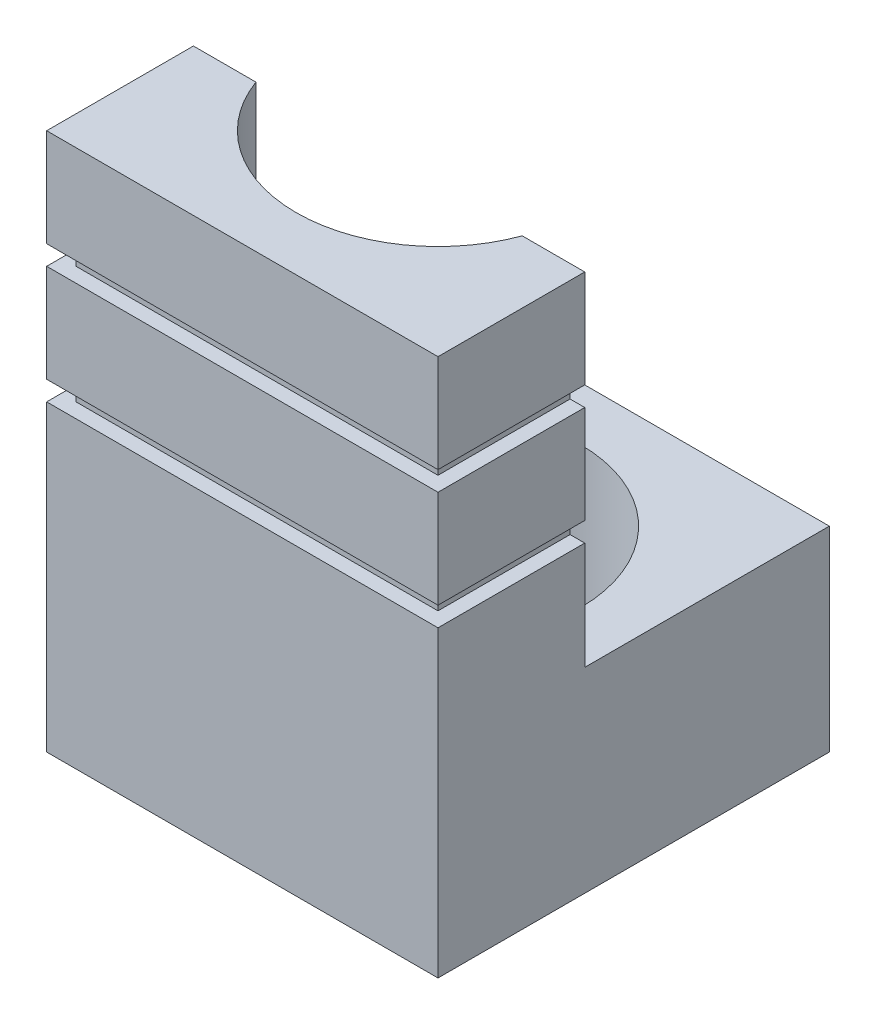
ISO-10303-21;
HEADER;
FILE_DESCRIPTION(('STEP AP214'),'2;1');
FILE_NAME('part.step','',(''),(''),'','','');
FILE_SCHEMA(('AUTOMOTIVE_DESIGN { 1 0 10303 214 1 1 1 1 }'));
ENDSEC;
DATA;
#1=APPLICATION_CONTEXT('core data for automotive mechanical design processes');
#2=APPLICATION_PROTOCOL_DEFINITION('international standard','automotive_design',2000,#1);
#3=PRODUCT_CONTEXT('',#1,'mechanical');
#4=PRODUCT('Part','Part','',(#3));
#5=PRODUCT_RELATED_PRODUCT_CATEGORY('part','',(#4));
#6=PRODUCT_DEFINITION_FORMATION('','',#4);
#7=PRODUCT_DEFINITION_CONTEXT('part definition',#1,'design');
#8=PRODUCT_DEFINITION('design','',#6,#7);
#9=PRODUCT_DEFINITION_SHAPE('','',#8);
#10=(LENGTH_UNIT() NAMED_UNIT(*) SI_UNIT(.MILLI.,.METRE.));
#11=(NAMED_UNIT(*) PLANE_ANGLE_UNIT() SI_UNIT($,.RADIAN.));
#12=(NAMED_UNIT(*) SI_UNIT($,.STERADIAN.) SOLID_ANGLE_UNIT());
#13=UNCERTAINTY_MEASURE_WITH_UNIT(LENGTH_MEASURE(1.E-05),#10,'distance_accuracy_value','');
#14=(GEOMETRIC_REPRESENTATION_CONTEXT(3) GLOBAL_UNCERTAINTY_ASSIGNED_CONTEXT((#13)) GLOBAL_UNIT_ASSIGNED_CONTEXT((#10,
#11,#12)) REPRESENTATION_CONTEXT('',''));
#15=CARTESIAN_POINT('',(0.,0.,0.));
#16=DIRECTION('',(0.,0.,1.));
#17=DIRECTION('',(1.,0.,0.));
#18=AXIS2_PLACEMENT_3D('',#15,#16,#17);
#19=CARTESIAN_POINT('',(80.,110.,0.));
#20=DIRECTION('',(0.,0.,-1.));
#21=DIRECTION('',(0.,1.,0.));
#22=AXIS2_PLACEMENT_3D('',#19,#20,#21);
#23=PLANE('',#22);
#24=DIRECTION('',(0.,-1.,0.));
#25=VECTOR('',#24,1.);
#26=CARTESIAN_POINT('',(0.,110.,0.));
#27=LINE('',#26,#25);
#28=CARTESIAN_POINT('',(0.,110.,0.));
#29=VERTEX_POINT('',#28);
#30=CARTESIAN_POINT('',(0.,90.,0.));
#31=VERTEX_POINT('',#30);
#32=EDGE_CURVE('E375',#29,#31,#27,.T.);
#33=ORIENTED_EDGE('',*,*,#32,.T.);
#34=DIRECTION('',(1.,0.,0.));
#35=VECTOR('',#34,1.);
#36=CARTESIAN_POINT('',(77.,90.,0.));
#37=LINE('',#36,#35);
#38=CARTESIAN_POINT('',(80.,90.,0.));
#39=VERTEX_POINT('',#38);
#40=EDGE_CURVE('E288',#31,#39,#37,.T.);
#41=ORIENTED_EDGE('',*,*,#40,.T.);
#42=DIRECTION('',(0.,-1.,0.));
#43=VECTOR('',#42,1.);
#44=CARTESIAN_POINT('',(80.,110.,0.));
#45=LINE('',#44,#43);
#46=CARTESIAN_POINT('',(80.,110.,0.));
#47=VERTEX_POINT('',#46);
#48=EDGE_CURVE('E350',#47,#39,#45,.T.);
#49=ORIENTED_EDGE('',*,*,#48,.F.);
#50=DIRECTION('',(-1.,0.,0.));
#51=VECTOR('',#50,1.);
#52=CARTESIAN_POINT('',(80.,110.,0.));
#53=LINE('',#52,#51);
#54=EDGE_CURVE('E374',#47,#29,#53,.T.);
#55=ORIENTED_EDGE('',*,*,#54,.T.);
#56=EDGE_LOOP('',(#33,#41,#49,#55));
#57=FACE_BOUND('',#56,.T.);
#58=ADVANCED_FACE('F37',(#57),#23,.F.);
#59=DIRECTION('',(1.,0.,0.));
#60=VECTOR('',#59,1.);
#61=CARTESIAN_POINT('',(77.,86.,0.));
#62=LINE('',#61,#60);
#63=CARTESIAN_POINT('',(0.,86.,0.));
#64=VERTEX_POINT('',#63);
#65=CARTESIAN_POINT('',(80.,86.,0.));
#66=VERTEX_POINT('',#65);
#67=EDGE_CURVE('E281',#64,#66,#62,.T.);
#68=ORIENTED_EDGE('',*,*,#67,.F.);
#69=CARTESIAN_POINT('',(0.,66.,0.));
#70=VERTEX_POINT('',#69);
#71=EDGE_CURVE('E380',#64,#70,#27,.T.);
#72=ORIENTED_EDGE('',*,*,#71,.T.);
#73=DIRECTION('',(1.,0.,0.));
#74=VECTOR('',#73,1.);
#75=CARTESIAN_POINT('',(77.,66.,0.));
#76=LINE('',#75,#74);
#77=CARTESIAN_POINT('',(80.,66.,0.));
#78=VERTEX_POINT('',#77);
#79=EDGE_CURVE('E285',#70,#78,#76,.T.);
#80=ORIENTED_EDGE('',*,*,#79,.T.);
#81=EDGE_CURVE('E355',#66,#78,#45,.T.);
#82=ORIENTED_EDGE('',*,*,#81,.F.);
#83=EDGE_LOOP('',(#68,#72,#80,#82));
#84=FACE_BOUND('',#83,.T.);
#85=ADVANCED_FACE('F462',(#84),#23,.F.);
#86=CARTESIAN_POINT('',(77.,0.,0.));
#87=DIRECTION('',(1.,0.,0.));
#88=DIRECTION('',(0.,0.,-1.));
#89=AXIS2_PLACEMENT_3D('',#86,#87,#88);
#90=PLANE('',#89);
#91=DIRECTION('',(0.,0.,1.));
#92=VECTOR('',#91,1.);
#93=CARTESIAN_POINT('',(77.,66.,0.));
#94=LINE('',#93,#92);
#95=CARTESIAN_POINT('',(77.,66.,-30.));
#96=VERTEX_POINT('',#95);
#97=CARTESIAN_POINT('',(77.,66.,-3.));
#98=VERTEX_POINT('',#97);
#99=EDGE_CURVE('E309',#96,#98,#94,.T.);
#100=ORIENTED_EDGE('',*,*,#99,.T.);
#101=DIRECTION('',(0.,1.,0.));
#102=VECTOR('',#101,1.);
#103=CARTESIAN_POINT('',(77.,66.,-3.));
#104=LINE('',#103,#102);
#105=CARTESIAN_POINT('',(77.,62.,-3.));
#106=VERTEX_POINT('',#105);
#107=EDGE_CURVE('E526',#106,#98,#104,.T.);
#108=ORIENTED_EDGE('',*,*,#107,.F.);
#109=DIRECTION('',(0.,0.,-1.));
#110=VECTOR('',#109,1.);
#111=CARTESIAN_POINT('',(77.,62.,0.));
#112=LINE('',#111,#110);
#113=CARTESIAN_POINT('',(77.,62.,-30.));
#114=VERTEX_POINT('',#113);
#115=EDGE_CURVE('E302',#106,#114,#112,.T.);
#116=ORIENTED_EDGE('',*,*,#115,.T.);
#117=DIRECTION('',(0.,1.,0.));
#118=VECTOR('',#117,1.);
#119=CARTESIAN_POINT('',(77.,66.,-30.));
#120=LINE('',#119,#118);
#121=EDGE_CURVE('E305',#114,#96,#120,.T.);
#122=ORIENTED_EDGE('',*,*,#121,.T.);
#123=EDGE_LOOP('',(#100,#108,#116,#122));
#124=FACE_BOUND('',#123,.T.);
#125=ADVANCED_FACE('F535',(#124),#90,.T.);
#126=CARTESIAN_POINT('',(77.,0.,0.));
#127=DIRECTION('',(1.,0.,0.));
#128=DIRECTION('',(0.,0.,-1.));
#129=AXIS2_PLACEMENT_3D('',#126,#127,#128);
#130=PLANE('',#129);
#131=DIRECTION('',(0.,0.,1.));
#132=VECTOR('',#131,1.);
#133=CARTESIAN_POINT('',(77.,90.,0.));
#134=LINE('',#133,#132);
#135=CARTESIAN_POINT('',(77.,90.,-30.));
#136=VERTEX_POINT('',#135);
#137=CARTESIAN_POINT('',(77.,90.,-3.));
#138=VERTEX_POINT('',#137);
#139=EDGE_CURVE('E277',#136,#138,#134,.T.);
#140=ORIENTED_EDGE('',*,*,#139,.T.);
#141=DIRECTION('',(0.,1.,0.));
#142=VECTOR('',#141,1.);
#143=CARTESIAN_POINT('',(77.,90.,-3.));
#144=LINE('',#143,#142);
#145=CARTESIAN_POINT('',(77.,86.,-3.));
#146=VERTEX_POINT('',#145);
#147=EDGE_CURVE('E210',#146,#138,#144,.T.);
#148=ORIENTED_EDGE('',*,*,#147,.F.);
#149=DIRECTION('',(0.,0.,-1.));
#150=VECTOR('',#149,1.);
#151=CARTESIAN_POINT('',(77.,86.,0.));
#152=LINE('',#151,#150);
#153=CARTESIAN_POINT('',(77.,86.,-30.));
#154=VERTEX_POINT('',#153);
#155=EDGE_CURVE('E207',#146,#154,#152,.T.);
#156=ORIENTED_EDGE('',*,*,#155,.T.);
#157=DIRECTION('',(0.,1.,0.));
#158=VECTOR('',#157,1.);
#159=CARTESIAN_POINT('',(77.,90.,-30.));
#160=LINE('',#159,#158);
#161=EDGE_CURVE('E273',#154,#136,#160,.T.);
#162=ORIENTED_EDGE('',*,*,#161,.T.);
#163=EDGE_LOOP('',(#140,#148,#156,#162));
#164=FACE_BOUND('',#163,.T.);
#165=ADVANCED_FACE('F512',(#164),#130,.T.);
#166=CARTESIAN_POINT('',(3.,0.,0.));
#167=DIRECTION('',(-1.,0.,0.));
#168=DIRECTION('',(0.,0.,1.));
#169=AXIS2_PLACEMENT_3D('',#166,#167,#168);
#170=PLANE('',#169);
#171=DIRECTION('',(0.,0.,1.));
#172=VECTOR('',#171,1.);
#173=CARTESIAN_POINT('',(3.,62.,-30.));
#174=LINE('',#173,#172);
#175=CARTESIAN_POINT('',(3.,62.,-30.));
#176=VERTEX_POINT('',#175);
#177=CARTESIAN_POINT('',(3.,62.,-3.));
#178=VERTEX_POINT('',#177);
#179=EDGE_CURVE('E251',#176,#178,#174,.T.);
#180=ORIENTED_EDGE('',*,*,#179,.T.);
#181=DIRECTION('',(0.,-1.,0.));
#182=VECTOR('',#181,1.);
#183=CARTESIAN_POINT('',(3.,66.,-3.));
#184=LINE('',#183,#182);
#185=CARTESIAN_POINT('',(3.,66.,-3.00000000000001));
#186=VERTEX_POINT('',#185);
#187=EDGE_CURVE('E520',#186,#178,#184,.T.);
#188=ORIENTED_EDGE('',*,*,#187,.F.);
#189=DIRECTION('',(0.,0.,-1.));
#190=VECTOR('',#189,1.);
#191=CARTESIAN_POINT('',(3.,66.,-30.));
#192=LINE('',#191,#190);
#193=CARTESIAN_POINT('',(3.,66.,-30.));
#194=VERTEX_POINT('',#193);
#195=EDGE_CURVE('E256',#186,#194,#192,.T.);
#196=ORIENTED_EDGE('',*,*,#195,.T.);
#197=DIRECTION('',(0.,-1.,0.));
#198=VECTOR('',#197,1.);
#199=CARTESIAN_POINT('',(3.,66.,-30.));
#200=LINE('',#199,#198);
#201=EDGE_CURVE('E247',#194,#176,#200,.T.);
#202=ORIENTED_EDGE('',*,*,#201,.T.);
#203=EDGE_LOOP('',(#180,#188,#196,#202));
#204=FACE_BOUND('',#203,.T.);
#205=ADVANCED_FACE('F542',(#204),#170,.T.);
#206=CARTESIAN_POINT('',(3.,0.,0.));
#207=DIRECTION('',(1.,0.,0.));
#208=DIRECTION('',(0.,0.,-1.));
#209=AXIS2_PLACEMENT_3D('',#206,#207,#208);
#210=PLANE('',#209);
#211=DIRECTION('',(0.,-1.,0.));
#212=VECTOR('',#211,1.);
#213=CARTESIAN_POINT('',(3.,90.,-3.));
#214=LINE('',#213,#212);
#215=CARTESIAN_POINT('',(3.,90.,-3.));
#216=VERTEX_POINT('',#215);
#217=CARTESIAN_POINT('',(3.,86.,-3.));
#218=VERTEX_POINT('',#217);
#219=EDGE_CURVE('E211',#216,#218,#214,.T.);
#220=ORIENTED_EDGE('',*,*,#219,.F.);
#221=DIRECTION('',(0.,0.,-1.));
#222=VECTOR('',#221,1.);
#223=CARTESIAN_POINT('',(3.,90.,-30.));
#224=LINE('',#223,#222);
#225=CARTESIAN_POINT('',(3.,90.,-30.));
#226=VERTEX_POINT('',#225);
#227=EDGE_CURVE('E223',#216,#226,#224,.T.);
#228=ORIENTED_EDGE('',*,*,#227,.T.);
#229=DIRECTION('',(0.,-1.,0.));
#230=VECTOR('',#229,1.);
#231=CARTESIAN_POINT('',(3.,90.,-30.));
#232=LINE('',#231,#230);
#233=CARTESIAN_POINT('',(3.,86.,-30.));
#234=VERTEX_POINT('',#233);
#235=EDGE_CURVE('E220',#226,#234,#232,.T.);
#236=ORIENTED_EDGE('',*,*,#235,.T.);
#237=DIRECTION('',(0.,0.,1.));
#238=VECTOR('',#237,1.);
#239=CARTESIAN_POINT('',(3.,86.,0.));
#240=LINE('',#239,#238);
#241=EDGE_CURVE('E204',#234,#218,#240,.T.);
#242=ORIENTED_EDGE('',*,*,#241,.T.);
#243=EDGE_LOOP('',(#220,#228,#236,#242));
#244=FACE_BOUND('',#243,.T.);
#245=ADVANCED_FACE('F218',(#244),#210,.F.);
#246=CARTESIAN_POINT('',(0.,0.,0.));
#247=DIRECTION('',(1.,0.,0.));
#248=DIRECTION('',(0.,0.,-1.));
#249=AXIS2_PLACEMENT_3D('',#246,#247,#248);
#250=PLANE('',#249);
#251=DIRECTION('',(0.,1.,0.));
#252=VECTOR('',#251,1.);
#253=CARTESIAN_POINT('',(0.,40.,-30.));
#254=LINE('',#253,#252);
#255=CARTESIAN_POINT('',(0.,90.,-30.));
#256=VERTEX_POINT('',#255);
#257=CARTESIAN_POINT('',(0.,110.,-30.));
#258=VERTEX_POINT('',#257);
#259=EDGE_CURVE('E390',#256,#258,#254,.T.);
#260=ORIENTED_EDGE('',*,*,#259,.F.);
#261=DIRECTION('',(0.,0.,-1.));
#262=VECTOR('',#261,1.);
#263=CARTESIAN_POINT('',(0.,90.,-30.));
#264=LINE('',#263,#262);
#265=EDGE_CURVE('E229',#31,#256,#264,.T.);
#266=ORIENTED_EDGE('',*,*,#265,.F.);
#267=ORIENTED_EDGE('',*,*,#32,.F.);
#268=DIRECTION('',(0.,0.,1.));
#269=VECTOR('',#268,1.);
#270=CARTESIAN_POINT('',(0.,110.,-30.));
#271=LINE('',#270,#269);
#272=EDGE_CURVE('E395',#258,#29,#271,.T.);
#273=ORIENTED_EDGE('',*,*,#272,.F.);
#274=EDGE_LOOP('',(#260,#266,#267,#273));
#275=FACE_BOUND('',#274,.T.);
#276=ADVANCED_FACE('F490',(#275),#250,.F.);
#277=ORIENTED_EDGE('',*,*,#71,.F.);
#278=DIRECTION('',(0.,0.,1.));
#279=VECTOR('',#278,1.);
#280=CARTESIAN_POINT('',(0.,86.,0.));
#281=LINE('',#280,#279);
#282=CARTESIAN_POINT('',(0.,86.,-30.));
#283=VERTEX_POINT('',#282);
#284=EDGE_CURVE('E233',#283,#64,#281,.T.);
#285=ORIENTED_EDGE('',*,*,#284,.F.);
#286=CARTESIAN_POINT('',(0.,66.,-30.));
#287=VERTEX_POINT('',#286);
#288=EDGE_CURVE('E396',#287,#283,#254,.T.);
#289=ORIENTED_EDGE('',*,*,#288,.F.);
#290=DIRECTION('',(0.,0.,-1.));
#291=VECTOR('',#290,1.);
#292=CARTESIAN_POINT('',(0.,66.,-30.));
#293=LINE('',#292,#291);
#294=EDGE_CURVE('E252',#70,#287,#293,.T.);
#295=ORIENTED_EDGE('',*,*,#294,.F.);
#296=EDGE_LOOP('',(#277,#285,#289,#295));
#297=FACE_BOUND('',#296,.T.);
#298=ADVANCED_FACE('F471',(#297),#250,.F.);
#299=CARTESIAN_POINT('',(80.,0.,0.));
#300=DIRECTION('',(1.,0.,0.));
#301=DIRECTION('',(0.,0.,-1.));
#302=AXIS2_PLACEMENT_3D('',#299,#300,#301);
#303=PLANE('',#302);
#304=DIRECTION('',(0.,0.,1.));
#305=VECTOR('',#304,1.);
#306=CARTESIAN_POINT('',(80.,90.,0.));
#307=LINE('',#306,#305);
#308=CARTESIAN_POINT('',(80.,90.,-30.));
#309=VERTEX_POINT('',#308);
#310=EDGE_CURVE('E274',#309,#39,#307,.T.);
#311=ORIENTED_EDGE('',*,*,#310,.F.);
#312=DIRECTION('',(0.,1.,0.));
#313=VECTOR('',#312,1.);
#314=CARTESIAN_POINT('',(80.,40.,-30.));
#315=LINE('',#314,#313);
#316=CARTESIAN_POINT('',(80.,110.,-30.));
#317=VERTEX_POINT('',#316);
#318=EDGE_CURVE('E365',#309,#317,#315,.T.);
#319=ORIENTED_EDGE('',*,*,#318,.T.);
#320=DIRECTION('',(0.,0.,1.));
#321=VECTOR('',#320,1.);
#322=CARTESIAN_POINT('',(80.,110.,-30.));
#323=LINE('',#322,#321);
#324=EDGE_CURVE('E370',#317,#47,#323,.T.);
#325=ORIENTED_EDGE('',*,*,#324,.T.);
#326=ORIENTED_EDGE('',*,*,#48,.T.);
#327=EDGE_LOOP('',(#311,#319,#325,#326));
#328=FACE_BOUND('',#327,.T.);
#329=ADVANCED_FACE('F497',(#328),#303,.T.);
#330=DIRECTION('',(0.,0.,-1.));
#331=VECTOR('',#330,1.);
#332=CARTESIAN_POINT('',(80.,86.,0.));
#333=LINE('',#332,#331);
#334=CARTESIAN_POINT('',(80.,86.,-30.));
#335=VERTEX_POINT('',#334);
#336=EDGE_CURVE('E282',#66,#335,#333,.T.);
#337=ORIENTED_EDGE('',*,*,#336,.F.);
#338=ORIENTED_EDGE('',*,*,#81,.T.);
#339=DIRECTION('',(0.,0.,1.));
#340=VECTOR('',#339,1.);
#341=CARTESIAN_POINT('',(80.,66.,0.));
#342=LINE('',#341,#340);
#343=CARTESIAN_POINT('',(80.,66.,-30.));
#344=VERTEX_POINT('',#343);
#345=EDGE_CURVE('E306',#344,#78,#342,.T.);
#346=ORIENTED_EDGE('',*,*,#345,.F.);
#347=EDGE_CURVE('E371',#344,#335,#315,.T.);
#348=ORIENTED_EDGE('',*,*,#347,.T.);
#349=EDGE_LOOP('',(#337,#338,#346,#348));
#350=FACE_BOUND('',#349,.T.);
#351=ADVANCED_FACE('F458',(#350),#303,.T.);
#352=CARTESIAN_POINT('',(80.,40.,-30.));
#353=DIRECTION('',(0.,0.,1.));
#354=DIRECTION('',(1.,0.,0.));
#355=AXIS2_PLACEMENT_3D('',#352,#353,#354);
#356=PLANE('',#355);
#357=ORIENTED_EDGE('',*,*,#318,.F.);
#358=DIRECTION('',(1.,0.,0.));
#359=VECTOR('',#358,1.);
#360=CARTESIAN_POINT('',(77.,90.,-30.));
#361=LINE('',#360,#359);
#362=EDGE_CURVE('E293',#136,#309,#361,.T.);
#363=ORIENTED_EDGE('',*,*,#362,.F.);
#364=ORIENTED_EDGE('',*,*,#161,.F.);
#365=DIRECTION('',(1.,0.,0.));
#366=VECTOR('',#365,1.);
#367=CARTESIAN_POINT('',(77.,86.,-30.));
#368=LINE('',#367,#366);
#369=EDGE_CURVE('E296',#154,#335,#368,.T.);
#370=ORIENTED_EDGE('',*,*,#369,.T.);
#371=ORIENTED_EDGE('',*,*,#347,.F.);
#372=DIRECTION('',(1.,0.,0.));
#373=VECTOR('',#372,1.);
#374=CARTESIAN_POINT('',(77.,66.,-30.));
#375=LINE('',#374,#373);
#376=EDGE_CURVE('E321',#96,#344,#375,.T.);
#377=ORIENTED_EDGE('',*,*,#376,.F.);
#378=ORIENTED_EDGE('',*,*,#121,.F.);
#379=DIRECTION('',(1.,0.,0.));
#380=VECTOR('',#379,1.);
#381=CARTESIAN_POINT('',(77.,62.,-30.));
#382=LINE('',#381,#380);
#383=CARTESIAN_POINT('',(80.,62.,-30.));
#384=VERTEX_POINT('',#383);
#385=EDGE_CURVE('E324',#114,#384,#382,.T.);
#386=ORIENTED_EDGE('',*,*,#385,.T.);
#387=CARTESIAN_POINT('',(80.,40.,-30.));
#388=VERTEX_POINT('',#387);
#389=EDGE_CURVE('E366',#388,#384,#315,.T.);
#390=ORIENTED_EDGE('',*,*,#389,.F.);
#391=DIRECTION('',(-1.,0.,0.));
#392=VECTOR('',#391,1.);
#393=CARTESIAN_POINT('',(80.,40.,-30.));
#394=LINE('',#393,#392);
#395=CARTESIAN_POINT('',(67.2213151776324,40.,-30.));
#396=VERTEX_POINT('',#395);
#397=EDGE_CURVE('E408',#388,#396,#394,.T.);
#398=ORIENTED_EDGE('',*,*,#397,.T.);
#399=DIRECTION('',(0.,1.,0.));
#400=VECTOR('',#399,1.);
#401=CARTESIAN_POINT('',(67.2213151776324,9.99999999999999,-30.));
#402=LINE('',#401,#400);
#403=CARTESIAN_POINT('',(67.2213151776324,110.,-30.));
#404=VERTEX_POINT('',#403);
#405=EDGE_CURVE('E345',#396,#404,#402,.T.);
#406=ORIENTED_EDGE('',*,*,#405,.T.);
#407=DIRECTION('',(-1.,0.,0.));
#408=VECTOR('',#407,1.);
#409=CARTESIAN_POINT('',(80.,110.,-30.));
#410=LINE('',#409,#408);
#411=EDGE_CURVE('E403',#317,#404,#410,.T.);
#412=ORIENTED_EDGE('',*,*,#411,.F.);
#413=EDGE_LOOP('',(#357,#363,#364,#370,#371,#377,#378,#386,#390,#398,#406,#412));
#414=FACE_BOUND('',#413,.T.);
#415=ADVANCED_FACE('F502',(#414),#356,.F.);
#416=DIRECTION('',(1.,0.,0.));
#417=VECTOR('',#416,1.);
#418=CARTESIAN_POINT('',(77.,62.,0.));
#419=LINE('',#418,#417);
#420=CARTESIAN_POINT('',(0.,62.,0.));
#421=VERTEX_POINT('',#420);
#422=CARTESIAN_POINT('',(80.,62.,0.));
#423=VERTEX_POINT('',#422);
#424=EDGE_CURVE('E313',#421,#423,#419,.T.);
#425=ORIENTED_EDGE('',*,*,#424,.F.);
#426=CARTESIAN_POINT('',(0.,0.,0.));
#427=VERTEX_POINT('',#426);
#428=EDGE_CURVE('E349',#421,#427,#27,.T.);
#429=ORIENTED_EDGE('',*,*,#428,.T.);
#430=DIRECTION('',(-1.,0.,0.));
#431=VECTOR('',#430,1.);
#432=CARTESIAN_POINT('',(80.,0.,0.));
#433=LINE('',#432,#431);
#434=CARTESIAN_POINT('',(80.,0.,0.));
#435=VERTEX_POINT('',#434);
#436=EDGE_CURVE('E47',#435,#427,#433,.T.);
#437=ORIENTED_EDGE('',*,*,#436,.F.);
#438=EDGE_CURVE('E356',#423,#435,#45,.T.);
#439=ORIENTED_EDGE('',*,*,#438,.F.);
#440=EDGE_LOOP('',(#425,#429,#437,#439));
#441=FACE_BOUND('',#440,.T.);
#442=ADVANCED_FACE('F39',(#441),#23,.F.);
#443=CARTESIAN_POINT('',(80.,0.,0.));
#444=DIRECTION('',(0.,1.,0.));
#445=DIRECTION('',(0.,0.,1.));
#446=AXIS2_PLACEMENT_3D('',#443,#444,#445);
#447=PLANE('',#446);
#448=CARTESIAN_POINT('',(40.,0.,-40.));
#449=DIRECTION('',(0.,-1.,0.));
#450=DIRECTION('',(0.,0.,-1.));
#451=AXIS2_PLACEMENT_3D('',#448,#449,#450);
#452=CIRCLE('',#451,24.);
#453=CARTESIAN_POINT('',(40.,0.,-64.));
#454=VERTEX_POINT('',#453);
#455=EDGE_CURVE('E292',#454,#454,#452,.T.);
#456=ORIENTED_EDGE('',*,*,#455,.F.);
#457=EDGE_LOOP('',(#456));
#458=FACE_BOUND('',#457,.T.);
#459=DIRECTION('',(0.,0.,-1.));
#460=VECTOR('',#459,1.);
#461=CARTESIAN_POINT('',(0.,0.,0.));
#462=LINE('',#461,#460);
#463=CARTESIAN_POINT('',(0.,0.,-80.));
#464=VERTEX_POINT('',#463);
#465=EDGE_CURVE('E379',#427,#464,#462,.T.);
#466=ORIENTED_EDGE('',*,*,#465,.T.);
#467=DIRECTION('',(-1.,0.,0.));
#468=VECTOR('',#467,1.);
#469=CARTESIAN_POINT('',(80.,0.,-80.));
#470=LINE('',#469,#468);
#471=CARTESIAN_POINT('',(80.,0.,-80.));
#472=VERTEX_POINT('',#471);
#473=EDGE_CURVE('E416',#472,#464,#470,.T.);
#474=ORIENTED_EDGE('',*,*,#473,.F.);
#475=DIRECTION('',(0.,0.,-1.));
#476=VECTOR('',#475,1.);
#477=CARTESIAN_POINT('',(80.,0.,0.));
#478=LINE('',#477,#476);
#479=EDGE_CURVE('E354',#435,#472,#478,.T.);
#480=ORIENTED_EDGE('',*,*,#479,.F.);
#481=ORIENTED_EDGE('',*,*,#436,.T.);
#482=EDGE_LOOP('',(#466,#474,#480,#481));
#483=FACE_BOUND('',#482,.T.);
#484=ADVANCED_FACE('F425',(#458,#483),#447,.F.);
#485=CARTESIAN_POINT('',(80.,0.,-80.));
#486=DIRECTION('',(0.,0.,1.));
#487=DIRECTION('',(1.,0.,0.));
#488=AXIS2_PLACEMENT_3D('',#485,#486,#487);
#489=PLANE('',#488);
#490=DIRECTION('',(0.,1.,0.));
#491=VECTOR('',#490,1.);
#492=CARTESIAN_POINT('',(0.,0.,-80.));
#493=LINE('',#492,#491);
#494=CARTESIAN_POINT('',(0.,40.,-80.));
#495=VERTEX_POINT('',#494);
#496=EDGE_CURVE('E383',#464,#495,#493,.T.);
#497=ORIENTED_EDGE('',*,*,#496,.T.);
#498=DIRECTION('',(-1.,0.,0.));
#499=VECTOR('',#498,1.);
#500=CARTESIAN_POINT('',(80.,40.,-80.));
#501=LINE('',#500,#499);
#502=CARTESIAN_POINT('',(80.,40.,-80.));
#503=VERTEX_POINT('',#502);
#504=EDGE_CURVE('E412',#503,#495,#501,.T.);
#505=ORIENTED_EDGE('',*,*,#504,.F.);
#506=DIRECTION('',(0.,1.,0.));
#507=VECTOR('',#506,1.);
#508=CARTESIAN_POINT('',(80.,0.,-80.));
#509=LINE('',#508,#507);
#510=EDGE_CURVE('E359',#472,#503,#509,.T.);
#511=ORIENTED_EDGE('',*,*,#510,.F.);
#512=ORIENTED_EDGE('',*,*,#473,.T.);
#513=EDGE_LOOP('',(#497,#505,#511,#512));
#514=FACE_BOUND('',#513,.T.);
#515=ADVANCED_FACE('F440',(#514),#489,.F.);
#516=CARTESIAN_POINT('',(80.,40.,-80.));
#517=DIRECTION('',(0.,-1.,0.));
#518=DIRECTION('',(0.,0.,-1.));
#519=AXIS2_PLACEMENT_3D('',#516,#517,#518);
#520=PLANE('',#519);
#521=CARTESIAN_POINT('',(12.7786848223676,40.,-30.));
#522=VERTEX_POINT('',#521);
#523=CARTESIAN_POINT('',(0.,40.,-30.));
#524=VERTEX_POINT('',#523);
#525=EDGE_CURVE('E407',#522,#524,#394,.T.);
#526=ORIENTED_EDGE('',*,*,#525,.F.);
#527=CARTESIAN_POINT('',(40.,40.,-40.));
#528=DIRECTION('',(0.,-1.,0.));
#529=DIRECTION('',(0.,0.,-1.));
#530=AXIS2_PLACEMENT_3D('',#527,#528,#529);
#531=CIRCLE('',#530,29.);
#532=EDGE_CURVE('E341',#522,#396,#531,.T.);
#533=ORIENTED_EDGE('',*,*,#532,.T.);
#534=ORIENTED_EDGE('',*,*,#397,.F.);
#535=DIRECTION('',(0.,0.,1.));
#536=VECTOR('',#535,1.);
#537=CARTESIAN_POINT('',(80.,40.,-80.));
#538=LINE('',#537,#536);
#539=EDGE_CURVE('E362',#503,#388,#538,.T.);
#540=ORIENTED_EDGE('',*,*,#539,.F.);
#541=ORIENTED_EDGE('',*,*,#504,.T.);
#542=DIRECTION('',(0.,0.,1.));
#543=VECTOR('',#542,1.);
#544=CARTESIAN_POINT('',(0.,40.,-80.));
#545=LINE('',#544,#543);
#546=EDGE_CURVE('E386',#495,#524,#545,.T.);
#547=ORIENTED_EDGE('',*,*,#546,.T.);
#548=EDGE_LOOP('',(#526,#533,#534,#540,#541,#547));
#549=FACE_BOUND('',#548,.T.);
#550=ADVANCED_FACE('F445',(#549),#520,.F.);
#551=ORIENTED_EDGE('',*,*,#235,.F.);
#552=DIRECTION('',(-1.,0.,0.));
#553=VECTOR('',#552,1.);
#554=CARTESIAN_POINT('',(3.,90.,-30.));
#555=LINE('',#554,#553);
#556=EDGE_CURVE('E240',#226,#256,#555,.T.);
#557=ORIENTED_EDGE('',*,*,#556,.T.);
#558=ORIENTED_EDGE('',*,*,#259,.T.);
#559=CARTESIAN_POINT('',(12.7786848223676,110.,-30.));
#560=VERTEX_POINT('',#559);
#561=EDGE_CURVE('E402',#560,#258,#410,.T.);
#562=ORIENTED_EDGE('',*,*,#561,.F.);
#563=DIRECTION('',(0.,1.,0.));
#564=VECTOR('',#563,1.);
#565=CARTESIAN_POINT('',(12.7786848223676,9.99999999999999,-30.));
#566=LINE('',#565,#564);
#567=EDGE_CURVE('E337',#560,#522,#566,.F.);
#568=ORIENTED_EDGE('',*,*,#567,.T.);
#569=ORIENTED_EDGE('',*,*,#525,.T.);
#570=CARTESIAN_POINT('',(0.,62.,-30.));
#571=VERTEX_POINT('',#570);
#572=EDGE_CURVE('E391',#524,#571,#254,.T.);
#573=ORIENTED_EDGE('',*,*,#572,.T.);
#574=DIRECTION('',(-1.,0.,0.));
#575=VECTOR('',#574,1.);
#576=CARTESIAN_POINT('',(3.,62.,-30.));
#577=LINE('',#576,#575);
#578=EDGE_CURVE('E259',#176,#571,#577,.T.);
#579=ORIENTED_EDGE('',*,*,#578,.F.);
#580=ORIENTED_EDGE('',*,*,#201,.F.);
#581=DIRECTION('',(-1.,0.,0.));
#582=VECTOR('',#581,1.);
#583=CARTESIAN_POINT('',(3.,66.,-30.));
#584=LINE('',#583,#582);
#585=EDGE_CURVE('E237',#194,#287,#584,.T.);
#586=ORIENTED_EDGE('',*,*,#585,.T.);
#587=ORIENTED_EDGE('',*,*,#288,.T.);
#588=DIRECTION('',(-1.,0.,0.));
#589=VECTOR('',#588,1.);
#590=CARTESIAN_POINT('',(3.,86.,-30.));
#591=LINE('',#590,#589);
#592=EDGE_CURVE('E227',#234,#283,#591,.T.);
#593=ORIENTED_EDGE('',*,*,#592,.F.);
#594=EDGE_LOOP('',(#551,#557,#558,#562,#568,#569,#573,#579,#580,#586,#587,#593));
#595=FACE_BOUND('',#594,.T.);
#596=ADVANCED_FACE('F480',(#595),#356,.F.);
#597=CARTESIAN_POINT('',(80.,110.,-30.));
#598=DIRECTION('',(0.,-1.,0.));
#599=DIRECTION('',(0.,0.,-1.));
#600=AXIS2_PLACEMENT_3D('',#597,#598,#599);
#601=PLANE('',#600);
#602=ORIENTED_EDGE('',*,*,#411,.T.);
#603=CARTESIAN_POINT('',(40.,110.,-40.));
#604=DIRECTION('',(0.,-1.,0.));
#605=DIRECTION('',(0.,0.,-1.));
#606=AXIS2_PLACEMENT_3D('',#603,#604,#605);
#607=CIRCLE('',#606,29.);
#608=EDGE_CURVE('E11',#404,#560,#607,.T.);
#609=ORIENTED_EDGE('',*,*,#608,.T.);
#610=ORIENTED_EDGE('',*,*,#561,.T.);
#611=ORIENTED_EDGE('',*,*,#272,.T.);
#612=ORIENTED_EDGE('',*,*,#54,.F.);
#613=ORIENTED_EDGE('',*,*,#324,.F.);
#614=EDGE_LOOP('',(#602,#609,#610,#611,#612,#613));
#615=FACE_BOUND('',#614,.T.);
#616=ADVANCED_FACE('F486',(#615),#601,.F.);
#617=DIRECTION('',(0.,0.,-1.));
#618=VECTOR('',#617,1.);
#619=CARTESIAN_POINT('',(80.,62.,0.));
#620=LINE('',#619,#618);
#621=EDGE_CURVE('E244',#423,#384,#620,.T.);
#622=ORIENTED_EDGE('',*,*,#621,.F.);
#623=ORIENTED_EDGE('',*,*,#438,.T.);
#624=ORIENTED_EDGE('',*,*,#479,.T.);
#625=ORIENTED_EDGE('',*,*,#510,.T.);
#626=ORIENTED_EDGE('',*,*,#539,.T.);
#627=ORIENTED_EDGE('',*,*,#389,.T.);
#628=EDGE_LOOP('',(#622,#623,#624,#625,#626,#627));
#629=FACE_BOUND('',#628,.T.);
#630=ADVANCED_FACE('F450',(#629),#303,.T.);
#631=ORIENTED_EDGE('',*,*,#428,.F.);
#632=DIRECTION('',(0.,0.,1.));
#633=VECTOR('',#632,1.);
#634=CARTESIAN_POINT('',(0.,62.,-30.));
#635=LINE('',#634,#633);
#636=EDGE_CURVE('E260',#571,#421,#635,.T.);
#637=ORIENTED_EDGE('',*,*,#636,.F.);
#638=ORIENTED_EDGE('',*,*,#572,.F.);
#639=ORIENTED_EDGE('',*,*,#546,.F.);
#640=ORIENTED_EDGE('',*,*,#496,.F.);
#641=ORIENTED_EDGE('',*,*,#465,.F.);
#642=EDGE_LOOP('',(#631,#637,#638,#639,#640,#641));
#643=FACE_BOUND('',#642,.T.);
#644=ADVANCED_FACE('F435',(#643),#250,.F.);
#645=CARTESIAN_POINT('',(40.,9.99999999999999,-40.));
#646=DIRECTION('',(0.,1.,0.));
#647=DIRECTION('',(0.,0.,1.));
#648=AXIS2_PLACEMENT_3D('',#645,#646,#647);
#649=CYLINDRICAL_SURFACE('',#648,29.);
#650=CARTESIAN_POINT('',(40.,9.99999999999999,-40.));
#651=DIRECTION('',(0.,1.,0.));
#652=DIRECTION('',(0.,0.,1.));
#653=AXIS2_PLACEMENT_3D('',#650,#651,#652);
#654=CIRCLE('',#653,29.);
#655=CARTESIAN_POINT('',(40.,9.99999999999999,-11.));
#656=VERTEX_POINT('',#655);
#657=EDGE_CURVE('E333',#656,#656,#654,.T.);
#658=ORIENTED_EDGE('',*,*,#657,.F.);
#659=EDGE_LOOP('',(#658));
#660=FACE_BOUND('',#659,.T.);
#661=ORIENTED_EDGE('',*,*,#532,.F.);
#662=ORIENTED_EDGE('',*,*,#567,.F.);
#663=ORIENTED_EDGE('',*,*,#608,.F.);
#664=ORIENTED_EDGE('',*,*,#405,.F.);
#665=EDGE_LOOP('',(#661,#662,#663,#664));
#666=FACE_BOUND('',#665,.T.);
#667=ADVANCED_FACE('F504',(#660,#666),#649,.F.);
#668=CARTESIAN_POINT('',(40.,9.99999999999999,-40.));
#669=DIRECTION('',(0.,1.,0.));
#670=DIRECTION('',(0.,0.,1.));
#671=AXIS2_PLACEMENT_3D('',#668,#669,#670);
#672=PLANE('',#671);
#673=CARTESIAN_POINT('',(40.,9.99999999999999,-40.));
#674=DIRECTION('',(0.,1.,0.));
#675=DIRECTION('',(0.,0.,1.));
#676=AXIS2_PLACEMENT_3D('',#673,#674,#675);
#677=CIRCLE('',#676,24.);
#678=CARTESIAN_POINT('',(40.,9.99999999999999,-16.));
#679=VERTEX_POINT('',#678);
#680=EDGE_CURVE('E41',#679,#679,#677,.T.);
#681=ORIENTED_EDGE('',*,*,#680,.F.);
#682=EDGE_LOOP('',(#681));
#683=FACE_BOUND('',#682,.T.);
#684=ORIENTED_EDGE('',*,*,#657,.T.);
#685=EDGE_LOOP('',(#684));
#686=FACE_BOUND('',#685,.T.);
#687=ADVANCED_FACE('F594',(#683,#686),#672,.T.);
#688=CARTESIAN_POINT('',(40.,110.,-40.));
#689=DIRECTION('',(0.,-1.,0.));
#690=DIRECTION('',(0.,0.,-1.));
#691=AXIS2_PLACEMENT_3D('',#688,#689,#690);
#692=CYLINDRICAL_SURFACE('',#691,24.);
#693=ORIENTED_EDGE('',*,*,#680,.T.);
#694=EDGE_LOOP('',(#693));
#695=FACE_BOUND('',#694,.T.);
#696=ORIENTED_EDGE('',*,*,#455,.T.);
#697=EDGE_LOOP('',(#696));
#698=FACE_BOUND('',#697,.T.);
#699=ADVANCED_FACE('F599',(#695,#698),#692,.F.);
#700=CARTESIAN_POINT('',(77.,66.,0.));
#701=DIRECTION('',(0.,1.,0.));
#702=DIRECTION('',(0.,0.,1.));
#703=AXIS2_PLACEMENT_3D('',#700,#701,#702);
#704=PLANE('',#703);
#705=ORIENTED_EDGE('',*,*,#345,.T.);
#706=ORIENTED_EDGE('',*,*,#79,.F.);
#707=ORIENTED_EDGE('',*,*,#294,.T.);
#708=ORIENTED_EDGE('',*,*,#585,.F.);
#709=ORIENTED_EDGE('',*,*,#195,.F.);
#710=DIRECTION('',(-1.,0.,0.));
#711=VECTOR('',#710,1.);
#712=CARTESIAN_POINT('',(3.,66.,-3.));
#713=LINE('',#712,#711);
#714=EDGE_CURVE('E54',#98,#186,#713,.T.);
#715=ORIENTED_EDGE('',*,*,#714,.F.);
#716=ORIENTED_EDGE('',*,*,#99,.F.);
#717=ORIENTED_EDGE('',*,*,#376,.T.);
#718=EDGE_LOOP('',(#705,#706,#707,#708,#709,#715,#716,#717));
#719=FACE_BOUND('',#718,.T.);
#720=ADVANCED_FACE('F467',(#719),#704,.F.);
#721=CARTESIAN_POINT('',(77.,62.,0.));
#722=DIRECTION('',(0.,-1.,0.));
#723=DIRECTION('',(0.,0.,-1.));
#724=AXIS2_PLACEMENT_3D('',#721,#722,#723);
#725=PLANE('',#724);
#726=ORIENTED_EDGE('',*,*,#621,.T.);
#727=ORIENTED_EDGE('',*,*,#385,.F.);
#728=ORIENTED_EDGE('',*,*,#115,.F.);
#729=DIRECTION('',(1.,0.,0.));
#730=VECTOR('',#729,1.);
#731=CARTESIAN_POINT('',(3.,62.,-3.));
#732=LINE('',#731,#730);
#733=EDGE_CURVE('E523',#178,#106,#732,.T.);
#734=ORIENTED_EDGE('',*,*,#733,.F.);
#735=ORIENTED_EDGE('',*,*,#179,.F.);
#736=ORIENTED_EDGE('',*,*,#578,.T.);
#737=ORIENTED_EDGE('',*,*,#636,.T.);
#738=ORIENTED_EDGE('',*,*,#424,.T.);
#739=EDGE_LOOP('',(#726,#727,#728,#734,#735,#736,#737,#738));
#740=FACE_BOUND('',#739,.T.);
#741=ADVANCED_FACE('F538',(#740),#725,.F.);
#742=CARTESIAN_POINT('',(77.,90.,0.));
#743=DIRECTION('',(0.,1.,0.));
#744=DIRECTION('',(0.,0.,1.));
#745=AXIS2_PLACEMENT_3D('',#742,#743,#744);
#746=PLANE('',#745);
#747=ORIENTED_EDGE('',*,*,#310,.T.);
#748=ORIENTED_EDGE('',*,*,#40,.F.);
#749=ORIENTED_EDGE('',*,*,#265,.T.);
#750=ORIENTED_EDGE('',*,*,#556,.F.);
#751=ORIENTED_EDGE('',*,*,#227,.F.);
#752=DIRECTION('',(-1.,0.,0.));
#753=VECTOR('',#752,1.);
#754=CARTESIAN_POINT('',(3.,90.,-3.));
#755=LINE('',#754,#753);
#756=EDGE_CURVE('E62',#138,#216,#755,.T.);
#757=ORIENTED_EDGE('',*,*,#756,.F.);
#758=ORIENTED_EDGE('',*,*,#139,.F.);
#759=ORIENTED_EDGE('',*,*,#362,.T.);
#760=EDGE_LOOP('',(#747,#748,#749,#750,#751,#757,#758,#759));
#761=FACE_BOUND('',#760,.T.);
#762=ADVANCED_FACE('F514',(#761),#746,.F.);
#763=CARTESIAN_POINT('',(77.,86.,0.));
#764=DIRECTION('',(0.,-1.,0.));
#765=DIRECTION('',(0.,0.,-1.));
#766=AXIS2_PLACEMENT_3D('',#763,#764,#765);
#767=PLANE('',#766);
#768=ORIENTED_EDGE('',*,*,#336,.T.);
#769=ORIENTED_EDGE('',*,*,#369,.F.);
#770=ORIENTED_EDGE('',*,*,#155,.F.);
#771=DIRECTION('',(1.,0.,0.));
#772=VECTOR('',#771,1.);
#773=CARTESIAN_POINT('',(3.,86.,-3.));
#774=LINE('',#773,#772);
#775=EDGE_CURVE('E201',#218,#146,#774,.T.);
#776=ORIENTED_EDGE('',*,*,#775,.F.);
#777=ORIENTED_EDGE('',*,*,#241,.F.);
#778=ORIENTED_EDGE('',*,*,#592,.T.);
#779=ORIENTED_EDGE('',*,*,#284,.T.);
#780=ORIENTED_EDGE('',*,*,#67,.T.);
#781=EDGE_LOOP('',(#768,#769,#770,#776,#777,#778,#779,#780));
#782=FACE_BOUND('',#781,.T.);
#783=ADVANCED_FACE('F202',(#782),#767,.F.);
#784=CARTESIAN_POINT('',(0.,0.,-3.));
#785=DIRECTION('',(0.,0.,1.));
#786=DIRECTION('',(1.,0.,0.));
#787=AXIS2_PLACEMENT_3D('',#784,#785,#786);
#788=PLANE('',#787);
#789=ORIENTED_EDGE('',*,*,#219,.T.);
#790=ORIENTED_EDGE('',*,*,#775,.T.);
#791=ORIENTED_EDGE('',*,*,#147,.T.);
#792=ORIENTED_EDGE('',*,*,#756,.T.);
#793=EDGE_LOOP('',(#789,#790,#791,#792));
#794=FACE_BOUND('',#793,.T.);
#795=ADVANCED_FACE('F213',(#794),#788,.T.);
#796=CARTESIAN_POINT('',(0.,0.,-3.));
#797=DIRECTION('',(0.,0.,1.));
#798=DIRECTION('',(1.,0.,0.));
#799=AXIS2_PLACEMENT_3D('',#796,#797,#798);
#800=PLANE('',#799);
#801=ORIENTED_EDGE('',*,*,#187,.T.);
#802=ORIENTED_EDGE('',*,*,#733,.T.);
#803=ORIENTED_EDGE('',*,*,#107,.T.);
#804=ORIENTED_EDGE('',*,*,#714,.T.);
#805=EDGE_LOOP('',(#801,#802,#803,#804));
#806=FACE_BOUND('',#805,.T.);
#807=ADVANCED_FACE('F530',(#806),#800,.T.);
#808=CLOSED_SHELL('',(#58,#85,#125,#165,#205,#245,#276,#298,#329,#351,#415,#442,#484,#515,#550,
#596,#616,#630,#644,#667,#687,#699,#720,#741,#762,#783,#795,#807));
#809=MANIFOLD_SOLID_BREP('B2',#808);
#810=ADVANCED_BREP_SHAPE_REPRESENTATION('',(#18,#809),#14);
#811=SHAPE_DEFINITION_REPRESENTATION(#9,#810);
ENDSEC;
END-ISO-10303-21;
